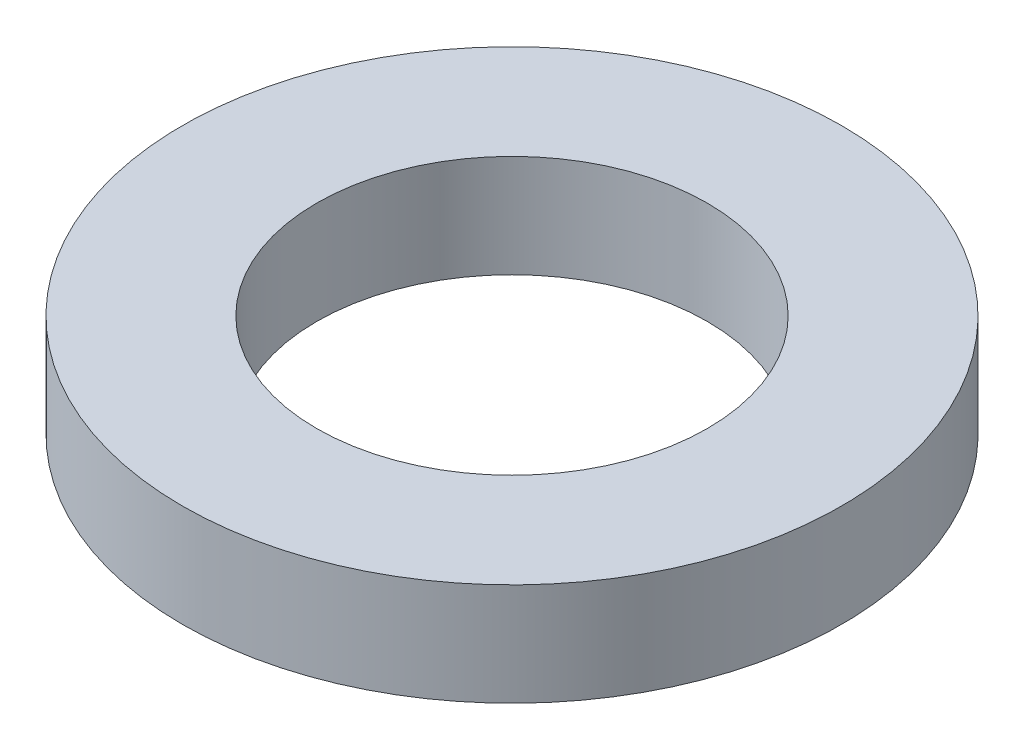
ISO-10303-21;
HEADER;
FILE_DESCRIPTION(('STEP AP214'),'2;1');
FILE_NAME('part.step','',(''),(''),'','','');
FILE_SCHEMA(('AUTOMOTIVE_DESIGN { 1 0 10303 214 1 1 1 1 }'));
ENDSEC;
DATA;
#1=APPLICATION_CONTEXT('core data for automotive mechanical design processes');
#2=APPLICATION_PROTOCOL_DEFINITION('international standard','automotive_design',2000,#1);
#3=PRODUCT_CONTEXT('',#1,'mechanical');
#4=PRODUCT('Part','Part','',(#3));
#5=PRODUCT_RELATED_PRODUCT_CATEGORY('part','',(#4));
#6=PRODUCT_DEFINITION_FORMATION('','',#4);
#7=PRODUCT_DEFINITION_CONTEXT('part definition',#1,'design');
#8=PRODUCT_DEFINITION('design','',#6,#7);
#9=PRODUCT_DEFINITION_SHAPE('','',#8);
#10=(LENGTH_UNIT() NAMED_UNIT(*) SI_UNIT(.MILLI.,.METRE.));
#11=(NAMED_UNIT(*) PLANE_ANGLE_UNIT() SI_UNIT($,.RADIAN.));
#12=(NAMED_UNIT(*) SI_UNIT($,.STERADIAN.) SOLID_ANGLE_UNIT());
#13=UNCERTAINTY_MEASURE_WITH_UNIT(LENGTH_MEASURE(1.E-05),#10,'distance_accuracy_value','');
#14=(GEOMETRIC_REPRESENTATION_CONTEXT(3) GLOBAL_UNCERTAINTY_ASSIGNED_CONTEXT((#13)) GLOBAL_UNIT_ASSIGNED_CONTEXT((#10,
#11,#12)) REPRESENTATION_CONTEXT('',''));
#15=CARTESIAN_POINT('',(0.,0.,0.));
#16=DIRECTION('',(0.,0.,1.));
#17=DIRECTION('',(1.,0.,0.));
#18=AXIS2_PLACEMENT_3D('',#15,#16,#17);
#19=CARTESIAN_POINT('',(0.,21.,0.));
#20=DIRECTION('',(0.,-1.,0.));
#21=DIRECTION('',(0.,0.,-1.));
#22=AXIS2_PLACEMENT_3D('',#19,#20,#21);
#23=CYLINDRICAL_SURFACE('',#22,67.5);
#24=CARTESIAN_POINT('',(0.,21.,0.));
#25=DIRECTION('',(0.,1.,0.));
#26=DIRECTION('',(0.,0.,1.));
#27=AXIS2_PLACEMENT_3D('',#24,#25,#26);
#28=CIRCLE('',#27,67.5);
#29=CARTESIAN_POINT('',(0.,21.,-67.5));
#30=VERTEX_POINT('',#29);
#31=EDGE_CURVE('E10',#30,#30,#28,.T.);
#32=CARTESIAN_POINT('',(0.,0.,0.));
#33=DIRECTION('',(0.,1.,0.));
#34=DIRECTION('',(0.,0.,1.));
#35=AXIS2_PLACEMENT_3D('',#32,#33,#34);
#36=CIRCLE('',#35,67.5);
#37=CARTESIAN_POINT('',(0.,0.,-67.5));
#38=VERTEX_POINT('',#37);
#39=EDGE_CURVE('E37',#38,#38,#36,.T.);
#40=CARTESIAN_POINT('',(0.,21.,-67.5));
#41=CARTESIAN_POINT('',(0.,20.78125,-67.5));
#42=CARTESIAN_POINT('',(0.,20.5625,-67.5));
#43=CARTESIAN_POINT('',(0.,20.125,-67.5));
#44=CARTESIAN_POINT('',(0.,19.90625,-67.5));
#45=CARTESIAN_POINT('',(0.,19.46875,-67.5));
#46=CARTESIAN_POINT('',(0.,19.25,-67.5));
#47=CARTESIAN_POINT('',(0.,18.8125,-67.5));
#48=CARTESIAN_POINT('',(0.,18.59375,-67.5));
#49=CARTESIAN_POINT('',(0.,18.15625,-67.5));
#50=CARTESIAN_POINT('',(0.,17.9375,-67.5));
#51=CARTESIAN_POINT('',(0.,17.5,-67.5));
#52=CARTESIAN_POINT('',(0.,17.28125,-67.5));
#53=CARTESIAN_POINT('',(0.,16.84375,-67.5));
#54=CARTESIAN_POINT('',(0.,16.625,-67.5));
#55=CARTESIAN_POINT('',(0.,16.1875,-67.5));
#56=CARTESIAN_POINT('',(0.,15.96875,-67.5));
#57=CARTESIAN_POINT('',(0.,15.53125,-67.5));
#58=CARTESIAN_POINT('',(0.,15.3125,-67.5));
#59=CARTESIAN_POINT('',(0.,14.875,-67.5));
#60=CARTESIAN_POINT('',(0.,14.65625,-67.5));
#61=CARTESIAN_POINT('',(0.,14.21875,-67.5));
#62=CARTESIAN_POINT('',(0.,14.,-67.5));
#63=CARTESIAN_POINT('',(0.,13.5625,-67.5));
#64=CARTESIAN_POINT('',(0.,13.34375,-67.5));
#65=CARTESIAN_POINT('',(0.,12.90625,-67.5));
#66=CARTESIAN_POINT('',(0.,12.6875,-67.5));
#67=CARTESIAN_POINT('',(0.,12.25,-67.5));
#68=CARTESIAN_POINT('',(0.,12.03125,-67.5));
#69=CARTESIAN_POINT('',(0.,11.59375,-67.5));
#70=CARTESIAN_POINT('',(0.,11.375,-67.5));
#71=CARTESIAN_POINT('',(0.,10.9375,-67.5));
#72=CARTESIAN_POINT('',(0.,10.71875,-67.5));
#73=CARTESIAN_POINT('',(0.,10.28125,-67.5));
#74=CARTESIAN_POINT('',(0.,10.0625,-67.5));
#75=CARTESIAN_POINT('',(0.,9.625,-67.5));
#76=CARTESIAN_POINT('',(0.,9.40625,-67.5));
#77=CARTESIAN_POINT('',(0.,8.96875,-67.5));
#78=CARTESIAN_POINT('',(0.,8.75,-67.5));
#79=CARTESIAN_POINT('',(0.,8.3125,-67.5));
#80=CARTESIAN_POINT('',(0.,8.09375,-67.5));
#81=CARTESIAN_POINT('',(0.,7.65625,-67.5));
#82=CARTESIAN_POINT('',(0.,7.4375,-67.5));
#83=CARTESIAN_POINT('',(0.,7.,-67.5));
#84=CARTESIAN_POINT('',(0.,6.78125,-67.5));
#85=CARTESIAN_POINT('',(0.,6.34375,-67.5));
#86=CARTESIAN_POINT('',(0.,6.125,-67.5));
#87=CARTESIAN_POINT('',(0.,5.6875,-67.5));
#88=CARTESIAN_POINT('',(0.,5.46875,-67.5));
#89=CARTESIAN_POINT('',(0.,5.03125,-67.5));
#90=CARTESIAN_POINT('',(0.,4.8125,-67.5));
#91=CARTESIAN_POINT('',(0.,4.375,-67.5));
#92=CARTESIAN_POINT('',(0.,4.15625,-67.5));
#93=CARTESIAN_POINT('',(0.,3.71875,-67.5));
#94=CARTESIAN_POINT('',(0.,3.5,-67.5));
#95=CARTESIAN_POINT('',(0.,3.0625,-67.5));
#96=CARTESIAN_POINT('',(0.,2.84375,-67.5));
#97=CARTESIAN_POINT('',(0.,2.40625,-67.5));
#98=CARTESIAN_POINT('',(0.,2.1875,-67.5));
#99=CARTESIAN_POINT('',(0.,1.75,-67.5));
#100=CARTESIAN_POINT('',(0.,1.53125,-67.5));
#101=CARTESIAN_POINT('',(0.,1.09375,-67.5));
#102=CARTESIAN_POINT('',(0.,0.875000000000001,-67.5));
#103=CARTESIAN_POINT('',(0.,0.4375,-67.5));
#104=CARTESIAN_POINT('',(0.,0.21875,-67.5));
#105=CARTESIAN_POINT('',(0.,0.,-67.5));
#106=B_SPLINE_CURVE_WITH_KNOTS('',3,(#40,#41,#42,#43,#44,#45,#46,#47,#48,#49,#50,#51,#52,#53,
#54,#55,#56,#57,#58,#59,#60,#61,#62,#63,#64,#65,#66,#67,#68,#69,#70,#71,#72,#73,#74,#75,#76,#77,
#78,#79,#80,#81,#82,#83,#84,#85,#86,#87,#88,#89,#90,#91,#92,#93,#94,#95,#96,#97,#98,#99,#100,
#101,#102,#103,#104,#105),.UNSPECIFIED.,.F.,.F.,(4,2,2,2,2,2,2,2,2,2,2,2,2,2,2,2,2,2,2,2,2,2,2,
2,2,2,2,2,2,2,2,2,4),(0.,0.656250000000001,1.3125,1.96875,2.625,3.28125,3.9375,4.59375,5.25,
5.90625,6.5625,7.21875,7.875,8.53125,9.1875,9.84375,10.5,11.15625,11.8125,12.46875,13.125,
13.78125,14.4375,15.09375,15.75,16.40625,17.0625,17.71875,18.375,19.03125,19.6875,20.34375,21.),.UNSPECIFIED.);
#107=EDGE_CURVE('BSEAM40',#30,#38,#106,.T.);
#108=ORIENTED_EDGE('',*,*,#31,.F.);
#109=ORIENTED_EDGE('',*,*,#39,.T.);
#110=ORIENTED_EDGE('',*,*,#107,.T.);
#111=ORIENTED_EDGE('',*,*,#107,.F.);
#112=EDGE_LOOP('',(#108,#110,#109,#111));
#113=FACE_BOUND('',#112,.T.);
#114=ADVANCED_FACE('F40',(#113),#23,.T.);
#115=CARTESIAN_POINT('',(0.,21.,0.));
#116=DIRECTION('',(0.,1.,0.));
#117=DIRECTION('',(0.,0.,1.));
#118=AXIS2_PLACEMENT_3D('',#115,#116,#117);
#119=PLANE('',#118);
#120=CARTESIAN_POINT('',(0.,21.,0.));
#121=DIRECTION('',(0.,1.,0.));
#122=DIRECTION('',(0.,0.,1.));
#123=AXIS2_PLACEMENT_3D('',#120,#121,#122);
#124=CIRCLE('',#123,40.);
#125=CARTESIAN_POINT('',(0.,21.,-40.));
#126=VERTEX_POINT('',#125);
#127=EDGE_CURVE('E50',#126,#126,#124,.T.);
#128=ORIENTED_EDGE('',*,*,#127,.F.);
#129=EDGE_LOOP('',(#128));
#130=FACE_BOUND('',#129,.T.);
#131=ORIENTED_EDGE('',*,*,#31,.T.);
#132=EDGE_LOOP('',(#131));
#133=FACE_BOUND('',#132,.T.);
#134=ADVANCED_FACE('F59',(#130,#133),#119,.T.);
#135=CARTESIAN_POINT('',(0.,0.,0.));
#136=DIRECTION('',(0.,1.,0.));
#137=DIRECTION('',(0.,0.,1.));
#138=AXIS2_PLACEMENT_3D('',#135,#136,#137);
#139=PLANE('',#138);
#140=CARTESIAN_POINT('',(0.,0.,0.));
#141=DIRECTION('',(0.,1.,0.));
#142=DIRECTION('',(0.,0.,1.));
#143=AXIS2_PLACEMENT_3D('',#140,#141,#142);
#144=CIRCLE('',#143,40.);
#145=CARTESIAN_POINT('',(0.,0.,-40.));
#146=VERTEX_POINT('',#145);
#147=EDGE_CURVE('E47',#146,#146,#144,.T.);
#148=ORIENTED_EDGE('',*,*,#147,.T.);
#149=EDGE_LOOP('',(#148));
#150=FACE_BOUND('',#149,.T.);
#151=ORIENTED_EDGE('',*,*,#39,.F.);
#152=EDGE_LOOP('',(#151));
#153=FACE_BOUND('',#152,.T.);
#154=ADVANCED_FACE('F58',(#150,#153),#139,.F.);
#155=CARTESIAN_POINT('',(0.,21.,0.));
#156=DIRECTION('',(0.,-1.,0.));
#157=DIRECTION('',(0.,0.,-1.));
#158=AXIS2_PLACEMENT_3D('',#155,#156,#157);
#159=CYLINDRICAL_SURFACE('',#158,40.);
#160=CARTESIAN_POINT('',(0.,21.,-40.));
#161=CARTESIAN_POINT('',(0.,20.78125,-40.));
#162=CARTESIAN_POINT('',(0.,20.5625,-40.));
#163=CARTESIAN_POINT('',(0.,20.125,-40.));
#164=CARTESIAN_POINT('',(0.,19.90625,-40.));
#165=CARTESIAN_POINT('',(0.,19.46875,-40.));
#166=CARTESIAN_POINT('',(0.,19.25,-40.));
#167=CARTESIAN_POINT('',(0.,18.8125,-40.));
#168=CARTESIAN_POINT('',(0.,18.59375,-40.));
#169=CARTESIAN_POINT('',(0.,18.15625,-40.));
#170=CARTESIAN_POINT('',(0.,17.9375,-40.));
#171=CARTESIAN_POINT('',(0.,17.5,-40.));
#172=CARTESIAN_POINT('',(0.,17.28125,-40.));
#173=CARTESIAN_POINT('',(0.,16.84375,-40.));
#174=CARTESIAN_POINT('',(0.,16.625,-40.));
#175=CARTESIAN_POINT('',(0.,16.1875,-40.));
#176=CARTESIAN_POINT('',(0.,15.96875,-40.));
#177=CARTESIAN_POINT('',(0.,15.53125,-40.));
#178=CARTESIAN_POINT('',(0.,15.3125,-40.));
#179=CARTESIAN_POINT('',(0.,14.875,-40.));
#180=CARTESIAN_POINT('',(0.,14.65625,-40.));
#181=CARTESIAN_POINT('',(0.,14.21875,-40.));
#182=CARTESIAN_POINT('',(0.,14.,-40.));
#183=CARTESIAN_POINT('',(0.,13.5625,-40.));
#184=CARTESIAN_POINT('',(0.,13.34375,-40.));
#185=CARTESIAN_POINT('',(0.,12.90625,-40.));
#186=CARTESIAN_POINT('',(0.,12.6875,-40.));
#187=CARTESIAN_POINT('',(0.,12.25,-40.));
#188=CARTESIAN_POINT('',(0.,12.03125,-40.));
#189=CARTESIAN_POINT('',(0.,11.59375,-40.));
#190=CARTESIAN_POINT('',(0.,11.375,-40.));
#191=CARTESIAN_POINT('',(0.,10.9375,-40.));
#192=CARTESIAN_POINT('',(0.,10.71875,-40.));
#193=CARTESIAN_POINT('',(0.,10.28125,-40.));
#194=CARTESIAN_POINT('',(0.,10.0625,-40.));
#195=CARTESIAN_POINT('',(0.,9.625,-40.));
#196=CARTESIAN_POINT('',(0.,9.40625,-40.));
#197=CARTESIAN_POINT('',(0.,8.96875,-40.));
#198=CARTESIAN_POINT('',(0.,8.75,-40.));
#199=CARTESIAN_POINT('',(0.,8.3125,-40.));
#200=CARTESIAN_POINT('',(0.,8.09375,-40.));
#201=CARTESIAN_POINT('',(0.,7.65625,-40.));
#202=CARTESIAN_POINT('',(0.,7.4375,-40.));
#203=CARTESIAN_POINT('',(0.,7.,-40.));
#204=CARTESIAN_POINT('',(0.,6.78125,-40.));
#205=CARTESIAN_POINT('',(0.,6.34375,-40.));
#206=CARTESIAN_POINT('',(0.,6.125,-40.));
#207=CARTESIAN_POINT('',(0.,5.6875,-40.));
#208=CARTESIAN_POINT('',(0.,5.46875,-40.));
#209=CARTESIAN_POINT('',(0.,5.03125,-40.));
#210=CARTESIAN_POINT('',(0.,4.8125,-40.));
#211=CARTESIAN_POINT('',(0.,4.375,-40.));
#212=CARTESIAN_POINT('',(0.,4.15625,-40.));
#213=CARTESIAN_POINT('',(0.,3.71875,-40.));
#214=CARTESIAN_POINT('',(0.,3.5,-40.));
#215=CARTESIAN_POINT('',(0.,3.0625,-40.));
#216=CARTESIAN_POINT('',(0.,2.84375,-40.));
#217=CARTESIAN_POINT('',(0.,2.40625,-40.));
#218=CARTESIAN_POINT('',(0.,2.1875,-40.));
#219=CARTESIAN_POINT('',(0.,1.75,-40.));
#220=CARTESIAN_POINT('',(0.,1.53125,-40.));
#221=CARTESIAN_POINT('',(0.,1.09375,-40.));
#222=CARTESIAN_POINT('',(0.,0.875000000000001,-40.));
#223=CARTESIAN_POINT('',(0.,0.4375,-40.));
#224=CARTESIAN_POINT('',(0.,0.21875,-40.));
#225=CARTESIAN_POINT('',(0.,0.,-40.));
#226=B_SPLINE_CURVE_WITH_KNOTS('',3,(#160,#161,#162,#163,#164,#165,#166,#167,#168,#169,#170,
#171,#172,#173,#174,#175,#176,#177,#178,#179,#180,#181,#182,#183,#184,#185,#186,#187,#188,#189,
#190,#191,#192,#193,#194,#195,#196,#197,#198,#199,#200,#201,#202,#203,#204,#205,#206,#207,#208,
#209,#210,#211,#212,#213,#214,#215,#216,#217,#218,#219,#220,#221,#222,#223,#224,#225),
.UNSPECIFIED.,.F.,.F.,(4,2,2,2,2,2,2,2,2,2,2,2,2,2,2,2,2,2,2,2,2,2,2,2,2,2,2,2,2,2,2,2,4),(0.,
0.656249999999997,1.3125,1.96875,2.625,3.28125,3.9375,4.59375,5.25,5.90625,6.5625,7.21875,7.875,
8.53125,9.1875,9.84375,10.5,11.15625,11.8125,12.46875,13.125,13.78125,14.4375,15.09375,15.75,
16.40625,17.0625,17.71875,18.375,19.03125,19.6875,20.34375,21.),.UNSPECIFIED.);
#227=EDGE_CURVE('BSEAM54',#126,#146,#226,.T.);
#228=ORIENTED_EDGE('',*,*,#127,.T.);
#229=ORIENTED_EDGE('',*,*,#147,.F.);
#230=ORIENTED_EDGE('',*,*,#227,.T.);
#231=ORIENTED_EDGE('',*,*,#227,.F.);
#232=EDGE_LOOP('',(#228,#230,#229,#231));
#233=FACE_BOUND('',#232,.T.);
#234=ADVANCED_FACE('F54',(#233),#159,.F.);
#235=CLOSED_SHELL('',(#114,#134,#154,#234));
#236=MANIFOLD_SOLID_BREP('B2',#235);
#237=ADVANCED_BREP_SHAPE_REPRESENTATION('',(#18,#236),#14);
#238=SHAPE_DEFINITION_REPRESENTATION(#9,#237);
ENDSEC;
END-ISO-10303-21;
